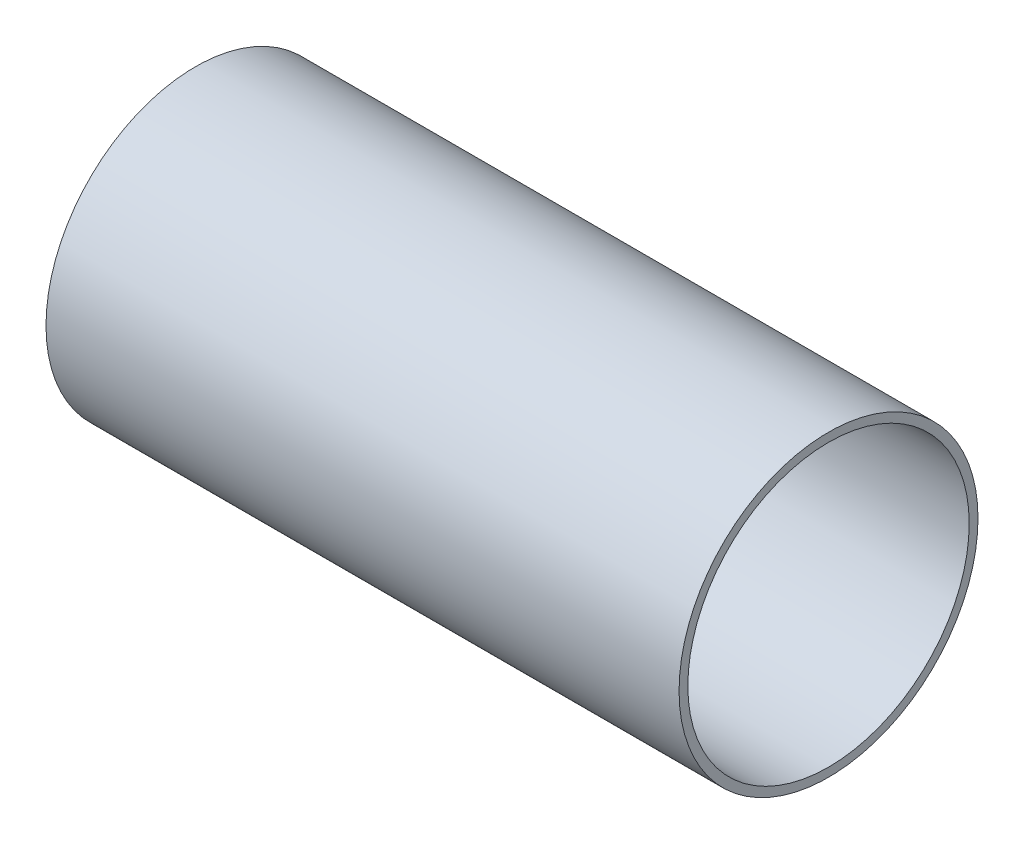
ISO-10303-21;
HEADER;
FILE_DESCRIPTION(('STEP AP214'),'2;1');
FILE_NAME('part.step','',(''),(''),'','','');
FILE_SCHEMA(('AUTOMOTIVE_DESIGN { 1 0 10303 214 1 1 1 1 }'));
ENDSEC;
DATA;
#1=APPLICATION_CONTEXT('core data for automotive mechanical design processes');
#2=APPLICATION_PROTOCOL_DEFINITION('international standard','automotive_design',2000,#1);
#3=PRODUCT_CONTEXT('',#1,'mechanical');
#4=PRODUCT('Part','Part','',(#3));
#5=PRODUCT_RELATED_PRODUCT_CATEGORY('part','',(#4));
#6=PRODUCT_DEFINITION_FORMATION('','',#4);
#7=PRODUCT_DEFINITION_CONTEXT('part definition',#1,'design');
#8=PRODUCT_DEFINITION('design','',#6,#7);
#9=PRODUCT_DEFINITION_SHAPE('','',#8);
#10=(LENGTH_UNIT() NAMED_UNIT(*) SI_UNIT(.MILLI.,.METRE.));
#11=(NAMED_UNIT(*) PLANE_ANGLE_UNIT() SI_UNIT($,.RADIAN.));
#12=(NAMED_UNIT(*) SI_UNIT($,.STERADIAN.) SOLID_ANGLE_UNIT());
#13=UNCERTAINTY_MEASURE_WITH_UNIT(LENGTH_MEASURE(1.E-05),#10,'distance_accuracy_value','');
#14=(GEOMETRIC_REPRESENTATION_CONTEXT(3) GLOBAL_UNCERTAINTY_ASSIGNED_CONTEXT((#13)) GLOBAL_UNIT_ASSIGNED_CONTEXT((#10,
#11,#12)) REPRESENTATION_CONTEXT('',''));
#15=CARTESIAN_POINT('',(0.,0.,0.));
#16=DIRECTION('',(0.,0.,1.));
#17=DIRECTION('',(1.,0.,0.));
#18=AXIS2_PLACEMENT_3D('',#15,#16,#17);
#19=CARTESIAN_POINT('',(228.6,0.,0.));
#20=DIRECTION('',(1.,0.,0.));
#21=DIRECTION('',(0.,0.,-1.));
#22=AXIS2_PLACEMENT_3D('',#19,#20,#21);
#23=PLANE('',#22);
#24=CARTESIAN_POINT('',(228.6,0.,0.));
#25=DIRECTION('',(1.,0.,0.));
#26=DIRECTION('',(0.,0.,-1.));
#27=AXIS2_PLACEMENT_3D('',#24,#25,#26);
#28=CIRCLE('',#27,53.975);
#29=CARTESIAN_POINT('',(228.6,0.,-53.975));
#30=VERTEX_POINT('',#29);
#31=EDGE_CURVE('E10',#30,#30,#28,.T.);
#32=ORIENTED_EDGE('',*,*,#31,.T.);
#33=EDGE_LOOP('',(#32));
#34=FACE_BOUND('',#33,.T.);
#35=CARTESIAN_POINT('',(228.6,0.,0.));
#36=DIRECTION('',(1.,0.,0.));
#37=DIRECTION('',(0.,0.,-1.));
#38=AXIS2_PLACEMENT_3D('',#35,#36,#37);
#39=CIRCLE('',#38,50.8);
#40=CARTESIAN_POINT('',(228.6,0.,-50.8));
#41=VERTEX_POINT('',#40);
#42=EDGE_CURVE('E42',#41,#41,#39,.T.);
#43=ORIENTED_EDGE('',*,*,#42,.F.);
#44=EDGE_LOOP('',(#43));
#45=FACE_BOUND('',#44,.T.);
#46=ADVANCED_FACE('F31',(#34,#45),#23,.T.);
#47=CARTESIAN_POINT('',(0.,0.,0.));
#48=DIRECTION('',(1.,0.,0.));
#49=DIRECTION('',(0.,0.,-1.));
#50=AXIS2_PLACEMENT_3D('',#47,#48,#49);
#51=PLANE('',#50);
#52=CARTESIAN_POINT('',(0.,0.,0.));
#53=DIRECTION('',(1.,0.,0.));
#54=DIRECTION('',(0.,0.,-1.));
#55=AXIS2_PLACEMENT_3D('',#52,#53,#54);
#56=CIRCLE('',#55,53.975);
#57=CARTESIAN_POINT('',(0.,0.,-53.975));
#58=VERTEX_POINT('',#57);
#59=EDGE_CURVE('E35',#58,#58,#56,.T.);
#60=ORIENTED_EDGE('',*,*,#59,.F.);
#61=EDGE_LOOP('',(#60));
#62=FACE_BOUND('',#61,.T.);
#63=CARTESIAN_POINT('',(0.,0.,0.));
#64=DIRECTION('',(1.,0.,0.));
#65=DIRECTION('',(0.,0.,-1.));
#66=AXIS2_PLACEMENT_3D('',#63,#64,#65);
#67=CIRCLE('',#66,50.8);
#68=CARTESIAN_POINT('',(0.,0.,-50.8));
#69=VERTEX_POINT('',#68);
#70=EDGE_CURVE('E44',#69,#69,#67,.T.);
#71=ORIENTED_EDGE('',*,*,#70,.T.);
#72=EDGE_LOOP('',(#71));
#73=FACE_BOUND('',#72,.T.);
#74=ADVANCED_FACE('F54',(#62,#73),#51,.F.);
#75=CARTESIAN_POINT('',(228.6,0.,0.));
#76=DIRECTION('',(-1.,0.,0.));
#77=DIRECTION('',(0.,0.,1.));
#78=AXIS2_PLACEMENT_3D('',#75,#76,#77);
#79=CYLINDRICAL_SURFACE('',#78,53.975);
#80=ORIENTED_EDGE('',*,*,#31,.F.);
#81=EDGE_LOOP('',(#80));
#82=FACE_BOUND('',#81,.T.);
#83=ORIENTED_EDGE('',*,*,#59,.T.);
#84=EDGE_LOOP('',(#83));
#85=FACE_BOUND('',#84,.T.);
#86=ADVANCED_FACE('F33',(#82,#85),#79,.T.);
#87=CARTESIAN_POINT('',(228.6,0.,0.));
#88=DIRECTION('',(-1.,0.,0.));
#89=DIRECTION('',(0.,0.,1.));
#90=AXIS2_PLACEMENT_3D('',#87,#88,#89);
#91=CYLINDRICAL_SURFACE('',#90,50.8);
#92=ORIENTED_EDGE('',*,*,#42,.T.);
#93=EDGE_LOOP('',(#92));
#94=FACE_BOUND('',#93,.T.);
#95=ORIENTED_EDGE('',*,*,#70,.F.);
#96=EDGE_LOOP('',(#95));
#97=FACE_BOUND('',#96,.T.);
#98=ADVANCED_FACE('F50',(#94,#97),#91,.F.);
#99=CLOSED_SHELL('',(#46,#74,#86,#98));
#100=MANIFOLD_SOLID_BREP('B2',#99);
#101=ADVANCED_BREP_SHAPE_REPRESENTATION('',(#18,#100),#14);
#102=SHAPE_DEFINITION_REPRESENTATION(#9,#101);
ENDSEC;
END-ISO-10303-21;
